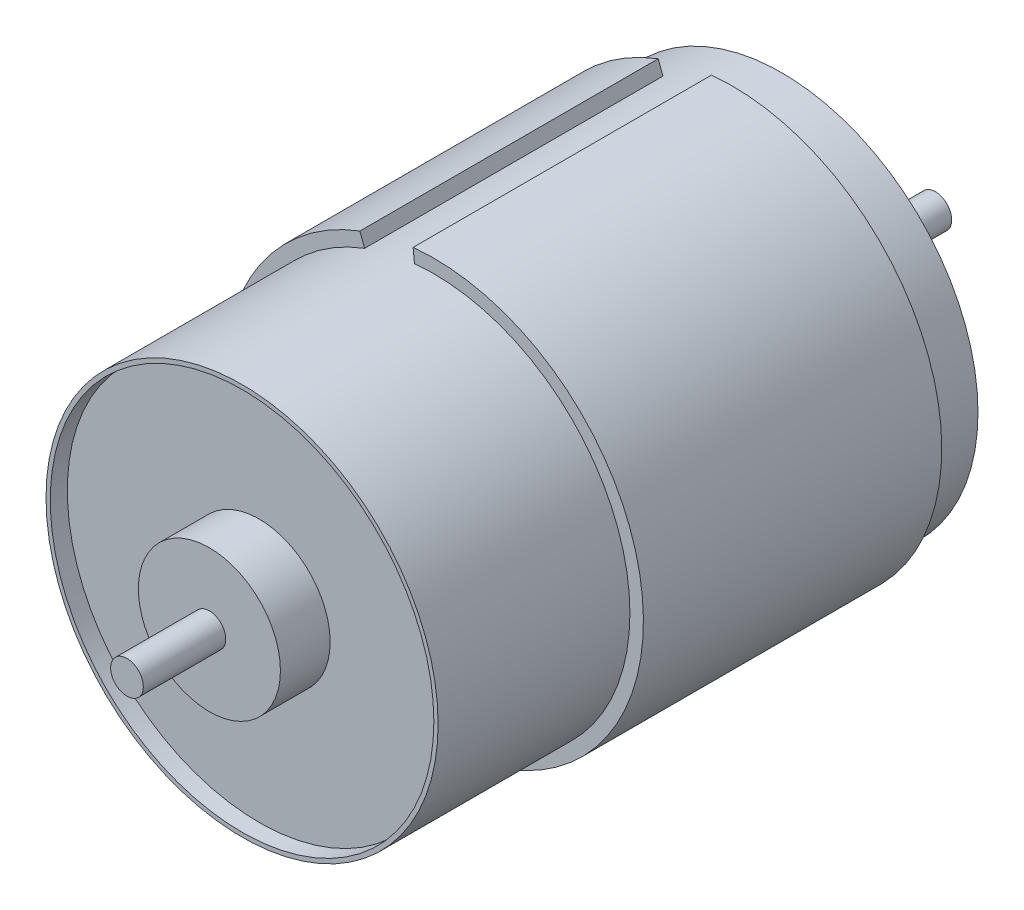
ISO-10303-21;
HEADER;
FILE_DESCRIPTION(('STEP AP214'),'2;1');
FILE_NAME('part.step','',(''),(''),'','','');
FILE_SCHEMA(('AUTOMOTIVE_DESIGN { 1 0 10303 214 1 1 1 1 }'));
ENDSEC;
DATA;
#1=APPLICATION_CONTEXT('core data for automotive mechanical design processes');
#2=APPLICATION_PROTOCOL_DEFINITION('international standard','automotive_design',2000,#1);
#3=PRODUCT_CONTEXT('',#1,'mechanical');
#4=PRODUCT('Part','Part','',(#3));
#5=PRODUCT_RELATED_PRODUCT_CATEGORY('part','',(#4));
#6=PRODUCT_DEFINITION_FORMATION('','',#4);
#7=PRODUCT_DEFINITION_CONTEXT('part definition',#1,'design');
#8=PRODUCT_DEFINITION('design','',#6,#7);
#9=PRODUCT_DEFINITION_SHAPE('','',#8);
#10=(LENGTH_UNIT() NAMED_UNIT(*) SI_UNIT(.MILLI.,.METRE.));
#11=(NAMED_UNIT(*) PLANE_ANGLE_UNIT() SI_UNIT($,.RADIAN.));
#12=(NAMED_UNIT(*) SI_UNIT($,.STERADIAN.) SOLID_ANGLE_UNIT());
#13=UNCERTAINTY_MEASURE_WITH_UNIT(LENGTH_MEASURE(1.E-05),#10,'distance_accuracy_value','');
#14=(GEOMETRIC_REPRESENTATION_CONTEXT(3) GLOBAL_UNCERTAINTY_ASSIGNED_CONTEXT((#13)) GLOBAL_UNIT_ASSIGNED_CONTEXT((#10,
#11,#12)) REPRESENTATION_CONTEXT('',''));
#15=CARTESIAN_POINT('',(0.,0.,0.));
#16=DIRECTION('',(0.,0.,1.));
#17=DIRECTION('',(1.,0.,0.));
#18=AXIS2_PLACEMENT_3D('',#15,#16,#17);
#19=CARTESIAN_POINT('',(0.,0.,38.));
#20=DIRECTION('',(0.,0.,-1.));
#21=DIRECTION('',(-1.,0.,0.));
#22=AXIS2_PLACEMENT_3D('',#19,#20,#21);
#23=CYLINDRICAL_SURFACE('',#22,13.8);
#24=DIRECTION('',(0.,0.,-1.));
#25=VECTOR('',#24,1.);
#26=CARTESIAN_POINT('',(-4.87250086650105,12.911186440678,24.5));
#27=LINE('',#26,#25);
#28=CARTESIAN_POINT('',(-4.87250086650104,12.911186440678,24.5));
#29=VERTEX_POINT('',#28);
#30=CARTESIAN_POINT('',(-4.87250086650104,12.911186440678,3.5));
#31=VERTEX_POINT('',#30);
#32=EDGE_CURVE('E58',#29,#31,#27,.T.);
#33=ORIENTED_EDGE('',*,*,#32,.F.);
#34=CARTESIAN_POINT('',(0.,0.,24.5));
#35=DIRECTION('',(0.,0.,-1.));
#36=DIRECTION('',(1.,0.,0.));
#37=AXIS2_PLACEMENT_3D('',#34,#35,#36);
#38=CIRCLE('',#37,13.8);
#39=CARTESIAN_POINT('',(-1.36481347985233,13.7323444526131,24.5));
#40=VERTEX_POINT('',#39);
#41=EDGE_CURVE('E53',#40,#29,#38,.T.);
#42=ORIENTED_EDGE('',*,*,#41,.F.);
#43=DIRECTION('',(0.,0.,-1.));
#44=VECTOR('',#43,1.);
#45=CARTESIAN_POINT('',(-1.36481347985233,13.7323444526131,24.5));
#46=LINE('',#45,#44);
#47=CARTESIAN_POINT('',(-1.36481347985233,13.7323444526131,3.5));
#48=VERTEX_POINT('',#47);
#49=EDGE_CURVE('E84',#40,#48,#46,.T.);
#50=ORIENTED_EDGE('',*,*,#49,.T.);
#51=CARTESIAN_POINT('',(0.,0.,3.5));
#52=DIRECTION('',(0.,0.,-1.));
#53=DIRECTION('',(1.,0.,0.));
#54=AXIS2_PLACEMENT_3D('',#51,#52,#53);
#55=CIRCLE('',#54,13.8);
#56=EDGE_CURVE('E140',#48,#31,#55,.T.);
#57=ORIENTED_EDGE('',*,*,#56,.T.);
#58=EDGE_LOOP('',(#33,#42,#50,#57));
#59=FACE_BOUND('',#58,.T.);
#60=CARTESIAN_POINT('',(0.,0.,38.));
#61=DIRECTION('',(0.,0.,1.));
#62=DIRECTION('',(1.,0.,0.));
#63=AXIS2_PLACEMENT_3D('',#60,#61,#62);
#64=CIRCLE('',#63,13.8);
#65=CARTESIAN_POINT('',(13.8,0.,38.));
#66=VERTEX_POINT('',#65);
#67=EDGE_CURVE('E108',#66,#66,#64,.T.);
#68=ORIENTED_EDGE('',*,*,#67,.F.);
#69=EDGE_LOOP('',(#68));
#70=FACE_BOUND('',#69,.T.);
#71=CARTESIAN_POINT('',(0.,0.,0.));
#72=DIRECTION('',(0.,0.,1.));
#73=DIRECTION('',(1.,0.,0.));
#74=AXIS2_PLACEMENT_3D('',#71,#72,#73);
#75=CIRCLE('',#74,13.8);
#76=CARTESIAN_POINT('',(13.8,0.,0.));
#77=VERTEX_POINT('',#76);
#78=EDGE_CURVE('E39',#77,#77,#75,.T.);
#79=ORIENTED_EDGE('',*,*,#78,.T.);
#80=EDGE_LOOP('',(#79));
#81=FACE_BOUND('',#80,.T.);
#82=ADVANCED_FACE('F36',(#59,#70,#81),#23,.T.);
#83=CARTESIAN_POINT('',(0.,0.,38.));
#84=DIRECTION('',(0.,0.,1.));
#85=DIRECTION('',(1.,0.,0.));
#86=AXIS2_PLACEMENT_3D('',#83,#84,#85);
#87=PLANE('',#86);
#88=CARTESIAN_POINT('',(0.,0.,38.));
#89=DIRECTION('',(0.,0.,1.));
#90=DIRECTION('',(1.,0.,0.));
#91=AXIS2_PLACEMENT_3D('',#88,#89,#90);
#92=CIRCLE('',#91,13.5);
#93=CARTESIAN_POINT('',(13.5,0.,38.));
#94=VERTEX_POINT('',#93);
#95=EDGE_CURVE('E265',#94,#94,#92,.T.);
#96=ORIENTED_EDGE('',*,*,#95,.F.);
#97=EDGE_LOOP('',(#96));
#98=FACE_BOUND('',#97,.T.);
#99=ORIENTED_EDGE('',*,*,#67,.T.);
#100=EDGE_LOOP('',(#99));
#101=FACE_BOUND('',#100,.T.);
#102=ADVANCED_FACE('F155',(#98,#101),#87,.T.);
#103=CARTESIAN_POINT('',(0.,0.,0.));
#104=DIRECTION('',(0.,0.,1.));
#105=DIRECTION('',(1.,0.,0.));
#106=AXIS2_PLACEMENT_3D('',#103,#104,#105);
#107=PLANE('',#106);
#108=CARTESIAN_POINT('',(7.78940199161894,1.82351764810843,0.));
#109=DIRECTION('',(0.,0.,-1.));
#110=DIRECTION('',(-1.,0.,0.));
#111=AXIS2_PLACEMENT_3D('',#108,#109,#110);
#112=CIRCLE('',#111,1.25);
#113=CARTESIAN_POINT('',(6.53940199161894,1.82351764810843,0.));
#114=VERTEX_POINT('',#113);
#115=EDGE_CURVE('E242',#114,#114,#112,.T.);
#116=ORIENTED_EDGE('',*,*,#115,.F.);
#117=EDGE_LOOP('',(#116));
#118=FACE_BOUND('',#117,.T.);
#119=CARTESIAN_POINT('',(-7.78940199161894,-1.82351764810842,0.));
#120=DIRECTION('',(0.,0.,-1.));
#121=DIRECTION('',(1.,0.,0.));
#122=AXIS2_PLACEMENT_3D('',#119,#120,#121);
#123=CIRCLE('',#122,1.25);
#124=CARTESIAN_POINT('',(-6.53940199161894,-1.82351764810842,0.));
#125=VERTEX_POINT('',#124);
#126=EDGE_CURVE('E255',#125,#125,#123,.T.);
#127=ORIENTED_EDGE('',*,*,#126,.F.);
#128=EDGE_LOOP('',(#127));
#129=FACE_BOUND('',#128,.T.);
#130=CARTESIAN_POINT('',(0.,0.,0.));
#131=DIRECTION('',(0.,0.,-1.));
#132=DIRECTION('',(-1.,0.,0.));
#133=AXIS2_PLACEMENT_3D('',#130,#131,#132);
#134=CIRCLE('',#133,5.);
#135=CARTESIAN_POINT('',(-5.,0.,0.));
#136=VERTEX_POINT('',#135);
#137=EDGE_CURVE('E114',#136,#136,#134,.T.);
#138=ORIENTED_EDGE('',*,*,#137,.F.);
#139=EDGE_LOOP('',(#138));
#140=FACE_BOUND('',#139,.T.);
#141=ORIENTED_EDGE('',*,*,#78,.F.);
#142=EDGE_LOOP('',(#141));
#143=FACE_BOUND('',#142,.T.);
#144=ADVANCED_FACE('F159',(#118,#129,#140,#143),#107,.F.);
#145=CARTESIAN_POINT('',(0.,0.,24.5));
#146=DIRECTION('',(0.,0.,-1.));
#147=DIRECTION('',(-1.,0.,0.));
#148=AXIS2_PLACEMENT_3D('',#145,#146,#147);
#149=CYLINDRICAL_SURFACE('',#148,14.75);
#150=CARTESIAN_POINT('',(0.,0.,3.5));
#151=DIRECTION('',(0.,0.,1.));
#152=DIRECTION('',(1.,0.,0.));
#153=AXIS2_PLACEMENT_3D('',#150,#151,#152);
#154=CIRCLE('',#153,14.75);
#155=CARTESIAN_POINT('',(-5.20792665078916,13.8,3.5));
#156=VERTEX_POINT('',#155);
#157=CARTESIAN_POINT('',(-1.45876803100159,14.6776870055104,3.5));
#158=VERTEX_POINT('',#157);
#159=EDGE_CURVE('E101',#156,#158,#154,.T.);
#160=ORIENTED_EDGE('',*,*,#159,.T.);
#161=DIRECTION('',(0.,0.,-1.));
#162=VECTOR('',#161,1.);
#163=CARTESIAN_POINT('',(-1.45876803100159,14.6776870055104,24.5));
#164=LINE('',#163,#162);
#165=CARTESIAN_POINT('',(-1.45876803100159,14.6776870055104,24.5));
#166=VERTEX_POINT('',#165);
#167=EDGE_CURVE('E82',#166,#158,#164,.T.);
#168=ORIENTED_EDGE('',*,*,#167,.F.);
#169=CARTESIAN_POINT('',(0.,0.,24.5));
#170=DIRECTION('',(0.,0.,1.));
#171=DIRECTION('',(1.,0.,0.));
#172=AXIS2_PLACEMENT_3D('',#169,#170,#171);
#173=CIRCLE('',#172,14.75);
#174=CARTESIAN_POINT('',(-5.20792665078916,13.8,24.5));
#175=VERTEX_POINT('',#174);
#176=EDGE_CURVE('E87',#175,#166,#173,.T.);
#177=ORIENTED_EDGE('',*,*,#176,.F.);
#178=DIRECTION('',(0.,0.,-1.));
#179=VECTOR('',#178,1.);
#180=CARTESIAN_POINT('',(-5.20792665078916,13.8,24.5));
#181=LINE('',#180,#179);
#182=EDGE_CURVE('E134',#175,#156,#181,.T.);
#183=ORIENTED_EDGE('',*,*,#182,.T.);
#184=EDGE_LOOP('',(#160,#168,#177,#183));
#185=FACE_BOUND('',#184,.T.);
#186=ADVANCED_FACE('F99',(#185),#149,.T.);
#187=CARTESIAN_POINT('',(-1.45876803100159,14.6776870055104,24.5));
#188=DIRECTION('',(0.995097424102397,0.0988995275255307,0.));
#189=DIRECTION('',(-0.0988995275255307,0.995097424102398,0.));
#190=AXIS2_PLACEMENT_3D('',#187,#188,#189);
#191=PLANE('',#190);
#192=DIRECTION('',(0.0988995275255307,-0.995097424102398,0.));
#193=VECTOR('',#192,1.);
#194=CARTESIAN_POINT('',(-1.45876803100159,14.6776870055104,3.5));
#195=LINE('',#194,#193);
#196=EDGE_CURVE('E137',#158,#48,#195,.T.);
#197=ORIENTED_EDGE('',*,*,#196,.T.);
#198=ORIENTED_EDGE('',*,*,#49,.F.);
#199=DIRECTION('',(0.0988995275255307,-0.995097424102398,0.));
#200=VECTOR('',#199,1.);
#201=CARTESIAN_POINT('',(-1.45876803100159,14.6776870055104,24.5));
#202=LINE('',#201,#200);
#203=EDGE_CURVE('E77',#166,#40,#202,.T.);
#204=ORIENTED_EDGE('',*,*,#203,.F.);
#205=ORIENTED_EDGE('',*,*,#167,.T.);
#206=EDGE_LOOP('',(#197,#198,#204,#205));
#207=FACE_BOUND('',#206,.T.);
#208=ADVANCED_FACE('F80',(#207),#191,.F.);
#209=CARTESIAN_POINT('',(-5.20792665078916,13.8,24.5));
#210=DIRECTION('',(-0.935593220338983,-0.353079772934858,0.));
#211=DIRECTION('',(0.353079772934859,-0.935593220338983,0.));
#212=AXIS2_PLACEMENT_3D('',#209,#210,#211);
#213=PLANE('',#212);
#214=DIRECTION('',(-0.353079772934858,0.935593220338983,0.));
#215=VECTOR('',#214,1.);
#216=CARTESIAN_POINT('',(-5.20792665078916,13.8,3.5));
#217=LINE('',#216,#215);
#218=EDGE_CURVE('E97',#31,#156,#217,.T.);
#219=ORIENTED_EDGE('',*,*,#218,.T.);
#220=ORIENTED_EDGE('',*,*,#182,.F.);
#221=DIRECTION('',(-0.353079772934858,0.935593220338983,0.));
#222=VECTOR('',#221,1.);
#223=CARTESIAN_POINT('',(-5.20792665078916,13.8,24.5));
#224=LINE('',#223,#222);
#225=EDGE_CURVE('E92',#29,#175,#224,.T.);
#226=ORIENTED_EDGE('',*,*,#225,.F.);
#227=ORIENTED_EDGE('',*,*,#32,.T.);
#228=EDGE_LOOP('',(#219,#220,#226,#227));
#229=FACE_BOUND('',#228,.T.);
#230=ADVANCED_FACE('F149',(#229),#213,.F.);
#231=CARTESIAN_POINT('',(0.,0.,24.5));
#232=DIRECTION('',(0.,0.,1.));
#233=DIRECTION('',(1.,0.,0.));
#234=AXIS2_PLACEMENT_3D('',#231,#232,#233);
#235=PLANE('',#234);
#236=ORIENTED_EDGE('',*,*,#176,.T.);
#237=ORIENTED_EDGE('',*,*,#203,.T.);
#238=ORIENTED_EDGE('',*,*,#41,.T.);
#239=ORIENTED_EDGE('',*,*,#225,.T.);
#240=EDGE_LOOP('',(#236,#237,#238,#239));
#241=FACE_BOUND('',#240,.T.);
#242=ADVANCED_FACE('F90',(#241),#235,.T.);
#243=CARTESIAN_POINT('',(0.,0.,3.5));
#244=DIRECTION('',(0.,0.,1.));
#245=DIRECTION('',(1.,0.,0.));
#246=AXIS2_PLACEMENT_3D('',#243,#244,#245);
#247=PLANE('',#246);
#248=ORIENTED_EDGE('',*,*,#159,.F.);
#249=ORIENTED_EDGE('',*,*,#218,.F.);
#250=ORIENTED_EDGE('',*,*,#56,.F.);
#251=ORIENTED_EDGE('',*,*,#196,.F.);
#252=EDGE_LOOP('',(#248,#249,#250,#251));
#253=FACE_BOUND('',#252,.T.);
#254=ADVANCED_FACE('F152',(#253),#247,.F.);
#255=CARTESIAN_POINT('',(0.,0.,-2.8));
#256=DIRECTION('',(0.,0.,1.));
#257=DIRECTION('',(1.,0.,0.));
#258=AXIS2_PLACEMENT_3D('',#255,#256,#257);
#259=CYLINDRICAL_SURFACE('',#258,5.);
#260=CARTESIAN_POINT('',(0.,0.,-2.8));
#261=DIRECTION('',(0.,0.,-1.));
#262=DIRECTION('',(-1.,0.,0.));
#263=AXIS2_PLACEMENT_3D('',#260,#261,#262);
#264=CIRCLE('',#263,5.);
#265=CARTESIAN_POINT('',(-5.,0.,-2.8));
#266=VERTEX_POINT('',#265);
#267=EDGE_CURVE('E128',#266,#266,#264,.T.);
#268=ORIENTED_EDGE('',*,*,#267,.F.);
#269=EDGE_LOOP('',(#268));
#270=FACE_BOUND('',#269,.T.);
#271=ORIENTED_EDGE('',*,*,#137,.T.);
#272=EDGE_LOOP('',(#271));
#273=FACE_BOUND('',#272,.T.);
#274=ADVANCED_FACE('F178',(#270,#273),#259,.T.);
#275=CARTESIAN_POINT('',(0.,0.,-2.8));
#276=DIRECTION('',(0.,0.,-1.));
#277=DIRECTION('',(-1.,0.,0.));
#278=AXIS2_PLACEMENT_3D('',#275,#276,#277);
#279=PLANE('',#278);
#280=CARTESIAN_POINT('',(0.,0.,-2.8));
#281=DIRECTION('',(0.,0.,-1.));
#282=DIRECTION('',(-1.,0.,0.));
#283=AXIS2_PLACEMENT_3D('',#280,#281,#282);
#284=CIRCLE('',#283,1.15);
#285=CARTESIAN_POINT('',(-1.15,0.,-2.8));
#286=VERTEX_POINT('',#285);
#287=EDGE_CURVE('E11',#286,#286,#284,.T.);
#288=ORIENTED_EDGE('',*,*,#287,.F.);
#289=EDGE_LOOP('',(#288));
#290=FACE_BOUND('',#289,.T.);
#291=ORIENTED_EDGE('',*,*,#267,.T.);
#292=EDGE_LOOP('',(#291));
#293=FACE_BOUND('',#292,.T.);
#294=ADVANCED_FACE('F183',(#290,#293),#279,.T.);
#295=CARTESIAN_POINT('',(0.,0.,36.8));
#296=DIRECTION('',(0.,0.,1.));
#297=DIRECTION('',(1.,0.,0.));
#298=AXIS2_PLACEMENT_3D('',#295,#296,#297);
#299=CYLINDRICAL_SURFACE('',#298,13.5);
#300=CARTESIAN_POINT('',(0.,0.,36.8));
#301=DIRECTION('',(0.,0.,1.));
#302=DIRECTION('',(1.,0.,0.));
#303=AXIS2_PLACEMENT_3D('',#300,#301,#302);
#304=CIRCLE('',#303,13.5);
#305=CARTESIAN_POINT('',(13.5,0.,36.8));
#306=VERTEX_POINT('',#305);
#307=EDGE_CURVE('E269',#306,#306,#304,.T.);
#308=ORIENTED_EDGE('',*,*,#307,.F.);
#309=EDGE_LOOP('',(#308));
#310=FACE_BOUND('',#309,.T.);
#311=ORIENTED_EDGE('',*,*,#95,.T.);
#312=EDGE_LOOP('',(#311));
#313=FACE_BOUND('',#312,.T.);
#314=ADVANCED_FACE('F187',(#310,#313),#299,.F.);
#315=CARTESIAN_POINT('',(0.,0.,36.8));
#316=DIRECTION('',(0.,0.,1.));
#317=DIRECTION('',(1.,0.,0.));
#318=AXIS2_PLACEMENT_3D('',#315,#316,#317);
#319=PLANE('',#318);
#320=CARTESIAN_POINT('',(0.,0.,36.8));
#321=DIRECTION('',(0.,0.,1.));
#322=DIRECTION('',(1.,0.,0.));
#323=AXIS2_PLACEMENT_3D('',#320,#321,#322);
#324=CIRCLE('',#323,5.);
#325=CARTESIAN_POINT('',(5.,0.,36.8));
#326=VERTEX_POINT('',#325);
#327=EDGE_CURVE('E260',#326,#326,#324,.T.);
#328=ORIENTED_EDGE('',*,*,#327,.F.);
#329=EDGE_LOOP('',(#328));
#330=FACE_BOUND('',#329,.T.);
#331=ORIENTED_EDGE('',*,*,#307,.T.);
#332=EDGE_LOOP('',(#331));
#333=FACE_BOUND('',#332,.T.);
#334=ADVANCED_FACE('F191',(#330,#333),#319,.T.);
#335=CARTESIAN_POINT('',(0.,0.,40.3));
#336=DIRECTION('',(0.,0.,-1.));
#337=DIRECTION('',(-1.,0.,0.));
#338=AXIS2_PLACEMENT_3D('',#335,#336,#337);
#339=CYLINDRICAL_SURFACE('',#338,5.);
#340=CARTESIAN_POINT('',(0.,0.,40.3));
#341=DIRECTION('',(0.,0.,1.));
#342=DIRECTION('',(1.,0.,0.));
#343=AXIS2_PLACEMENT_3D('',#340,#341,#342);
#344=CIRCLE('',#343,5.);
#345=CARTESIAN_POINT('',(5.,0.,40.3));
#346=VERTEX_POINT('',#345);
#347=EDGE_CURVE('E262',#346,#346,#344,.T.);
#348=ORIENTED_EDGE('',*,*,#347,.F.);
#349=EDGE_LOOP('',(#348));
#350=FACE_BOUND('',#349,.T.);
#351=ORIENTED_EDGE('',*,*,#327,.T.);
#352=EDGE_LOOP('',(#351));
#353=FACE_BOUND('',#352,.T.);
#354=ADVANCED_FACE('F195',(#350,#353),#339,.T.);
#355=CARTESIAN_POINT('',(0.,0.,40.3));
#356=DIRECTION('',(0.,0.,1.));
#357=DIRECTION('',(1.,0.,0.));
#358=AXIS2_PLACEMENT_3D('',#355,#356,#357);
#359=PLANE('',#358);
#360=CARTESIAN_POINT('',(0.,0.,40.3));
#361=DIRECTION('',(0.,0.,1.));
#362=DIRECTION('',(1.,0.,0.));
#363=AXIS2_PLACEMENT_3D('',#360,#361,#362);
#364=CIRCLE('',#363,1.15);
#365=CARTESIAN_POINT('',(1.15,0.,40.3));
#366=VERTEX_POINT('',#365);
#367=EDGE_CURVE('E45',#366,#366,#364,.T.);
#368=ORIENTED_EDGE('',*,*,#367,.F.);
#369=EDGE_LOOP('',(#368));
#370=FACE_BOUND('',#369,.T.);
#371=ORIENTED_EDGE('',*,*,#347,.T.);
#372=EDGE_LOOP('',(#371));
#373=FACE_BOUND('',#372,.T.);
#374=ADVANCED_FACE('F199',(#370,#373),#359,.T.);
#375=CARTESIAN_POINT('',(0.,0.,46.1));
#376=DIRECTION('',(0.,0.,-1.));
#377=DIRECTION('',(-1.,0.,0.));
#378=AXIS2_PLACEMENT_3D('',#375,#376,#377);
#379=CYLINDRICAL_SURFACE('',#378,1.15);
#380=CARTESIAN_POINT('',(0.,0.,46.1));
#381=DIRECTION('',(0.,0.,1.));
#382=DIRECTION('',(1.,0.,0.));
#383=AXIS2_PLACEMENT_3D('',#380,#381,#382);
#384=CIRCLE('',#383,1.15);
#385=CARTESIAN_POINT('',(1.15,0.,46.1));
#386=VERTEX_POINT('',#385);
#387=EDGE_CURVE('E246',#386,#386,#384,.T.);
#388=ORIENTED_EDGE('',*,*,#387,.F.);
#389=EDGE_LOOP('',(#388));
#390=FACE_BOUND('',#389,.T.);
#391=ORIENTED_EDGE('',*,*,#367,.T.);
#392=EDGE_LOOP('',(#391));
#393=FACE_BOUND('',#392,.T.);
#394=ADVANCED_FACE('F203',(#390,#393),#379,.T.);
#395=CARTESIAN_POINT('',(0.,0.,46.1));
#396=DIRECTION('',(0.,0.,1.));
#397=DIRECTION('',(1.,0.,0.));
#398=AXIS2_PLACEMENT_3D('',#395,#396,#397);
#399=PLANE('',#398);
#400=ORIENTED_EDGE('',*,*,#387,.T.);
#401=EDGE_LOOP('',(#400));
#402=FACE_BOUND('',#401,.T.);
#403=ADVANCED_FACE('F207',(#402),#399,.T.);
#404=CARTESIAN_POINT('',(0.,0.,-10.8));
#405=DIRECTION('',(0.,0.,1.));
#406=DIRECTION('',(1.,0.,0.));
#407=AXIS2_PLACEMENT_3D('',#404,#405,#406);
#408=CYLINDRICAL_SURFACE('',#407,1.15);
#409=CARTESIAN_POINT('',(0.,0.,-10.8));
#410=DIRECTION('',(0.,0.,-1.));
#411=DIRECTION('',(-1.,0.,0.));
#412=AXIS2_PLACEMENT_3D('',#409,#410,#411);
#413=CIRCLE('',#412,1.15);
#414=CARTESIAN_POINT('',(-1.15,0.,-10.8));
#415=VERTEX_POINT('',#414);
#416=EDGE_CURVE('E241',#415,#415,#413,.T.);
#417=ORIENTED_EDGE('',*,*,#416,.F.);
#418=EDGE_LOOP('',(#417));
#419=FACE_BOUND('',#418,.T.);
#420=ORIENTED_EDGE('',*,*,#287,.T.);
#421=EDGE_LOOP('',(#420));
#422=FACE_BOUND('',#421,.T.);
#423=ADVANCED_FACE('F211',(#419,#422),#408,.T.);
#424=CARTESIAN_POINT('',(0.,0.,-10.8));
#425=DIRECTION('',(0.,0.,-1.));
#426=DIRECTION('',(-1.,0.,0.));
#427=AXIS2_PLACEMENT_3D('',#424,#425,#426);
#428=PLANE('',#427);
#429=ORIENTED_EDGE('',*,*,#416,.T.);
#430=EDGE_LOOP('',(#429));
#431=FACE_BOUND('',#430,.T.);
#432=ADVANCED_FACE('F215',(#431),#428,.T.);
#433=CARTESIAN_POINT('',(-7.78940199161894,-1.82351764810842,8.));
#434=DIRECTION('',(0.,0.,-1.));
#435=DIRECTION('',(-1.,0.,0.));
#436=AXIS2_PLACEMENT_3D('',#433,#434,#435);
#437=CYLINDRICAL_SURFACE('',#436,1.25);
#438=CARTESIAN_POINT('',(-7.78940199161894,-1.82351764810842,8.));
#439=DIRECTION('',(0.,0.,-1.));
#440=DIRECTION('',(1.,0.,0.));
#441=AXIS2_PLACEMENT_3D('',#438,#439,#440);
#442=CIRCLE('',#441,1.25);
#443=CARTESIAN_POINT('',(-6.53940199161894,-1.82351764810842,8.));
#444=VERTEX_POINT('',#443);
#445=EDGE_CURVE('E249',#444,#444,#442,.T.);
#446=ORIENTED_EDGE('',*,*,#445,.F.);
#447=EDGE_LOOP('',(#446));
#448=FACE_BOUND('',#447,.T.);
#449=ORIENTED_EDGE('',*,*,#126,.T.);
#450=EDGE_LOOP('',(#449));
#451=FACE_BOUND('',#450,.T.);
#452=ADVANCED_FACE('F219',(#448,#451),#437,.F.);
#453=CARTESIAN_POINT('',(-7.78940199161894,-1.82351764810842,8.));
#454=DIRECTION('',(0.,0.,1.));
#455=DIRECTION('',(1.,0.,0.));
#456=AXIS2_PLACEMENT_3D('',#453,#454,#455);
#457=PLANE('',#456);
#458=ORIENTED_EDGE('',*,*,#445,.T.);
#459=EDGE_LOOP('',(#458));
#460=FACE_BOUND('',#459,.T.);
#461=ADVANCED_FACE('F223',(#460),#457,.F.);
#462=CARTESIAN_POINT('',(7.78940199161894,1.82351764810843,8.));
#463=DIRECTION('',(0.,0.,-1.));
#464=DIRECTION('',(-1.,0.,0.));
#465=AXIS2_PLACEMENT_3D('',#462,#463,#464);
#466=CYLINDRICAL_SURFACE('',#465,1.25);
#467=CARTESIAN_POINT('',(7.78940199161894,1.82351764810843,8.));
#468=DIRECTION('',(0.,0.,-1.));
#469=DIRECTION('',(-1.,0.,0.));
#470=AXIS2_PLACEMENT_3D('',#467,#468,#469);
#471=CIRCLE('',#470,1.25);
#472=CARTESIAN_POINT('',(6.53940199161894,1.82351764810843,8.));
#473=VERTEX_POINT('',#472);
#474=EDGE_CURVE('E239',#473,#473,#471,.T.);
#475=ORIENTED_EDGE('',*,*,#474,.F.);
#476=EDGE_LOOP('',(#475));
#477=FACE_BOUND('',#476,.T.);
#478=ORIENTED_EDGE('',*,*,#115,.T.);
#479=EDGE_LOOP('',(#478));
#480=FACE_BOUND('',#479,.T.);
#481=ADVANCED_FACE('F227',(#477,#480),#466,.F.);
#482=CARTESIAN_POINT('',(7.78940199161894,1.82351764810843,8.));
#483=DIRECTION('',(0.,0.,-1.));
#484=DIRECTION('',(-1.,0.,0.));
#485=AXIS2_PLACEMENT_3D('',#482,#483,#484);
#486=PLANE('',#485);
#487=ORIENTED_EDGE('',*,*,#474,.T.);
#488=EDGE_LOOP('',(#487));
#489=FACE_BOUND('',#488,.T.);
#490=ADVANCED_FACE('F231',(#489),#486,.T.);
#491=CLOSED_SHELL('',(#82,#102,#144,#186,#208,#230,#242,#254,#274,#294,#314,#334,#354,#374,#394,
#403,#423,#432,#452,#461,#481,#490));
#492=MANIFOLD_SOLID_BREP('B2',#491);
#493=ADVANCED_BREP_SHAPE_REPRESENTATION('',(#18,#492),#14);
#494=SHAPE_DEFINITION_REPRESENTATION(#9,#493);
ENDSEC;
END-ISO-10303-21;
